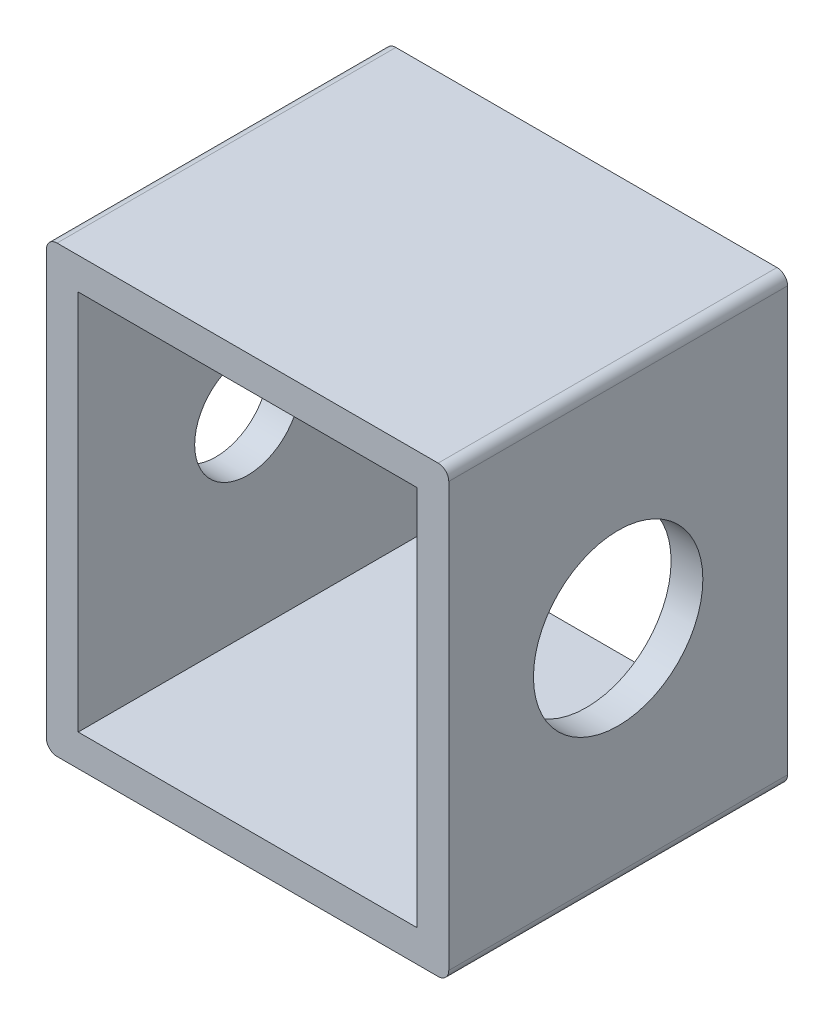
ISO-10303-21;
HEADER;
FILE_DESCRIPTION(('STEP AP214'),'2;1');
FILE_NAME('part.step','',(''),(''),'','','');
FILE_SCHEMA(('AUTOMOTIVE_DESIGN { 1 0 10303 214 1 1 1 1 }'));
ENDSEC;
DATA;
#1=APPLICATION_CONTEXT('core data for automotive mechanical design processes');
#2=APPLICATION_PROTOCOL_DEFINITION('international standard','automotive_design',2000,#1);
#3=PRODUCT_CONTEXT('',#1,'mechanical');
#4=PRODUCT('Part','Part','',(#3));
#5=PRODUCT_RELATED_PRODUCT_CATEGORY('part','',(#4));
#6=PRODUCT_DEFINITION_FORMATION('','',#4);
#7=PRODUCT_DEFINITION_CONTEXT('part definition',#1,'design');
#8=PRODUCT_DEFINITION('design','',#6,#7);
#9=PRODUCT_DEFINITION_SHAPE('','',#8);
#10=(LENGTH_UNIT() NAMED_UNIT(*) SI_UNIT(.MILLI.,.METRE.));
#11=(NAMED_UNIT(*) PLANE_ANGLE_UNIT() SI_UNIT($,.RADIAN.));
#12=(NAMED_UNIT(*) SI_UNIT($,.STERADIAN.) SOLID_ANGLE_UNIT());
#13=UNCERTAINTY_MEASURE_WITH_UNIT(LENGTH_MEASURE(1.E-05),#10,'distance_accuracy_value','');
#14=(GEOMETRIC_REPRESENTATION_CONTEXT(3) GLOBAL_UNCERTAINTY_ASSIGNED_CONTEXT((#13)) GLOBAL_UNIT_ASSIGNED_CONTEXT((#10,
#11,#12)) REPRESENTATION_CONTEXT('',''));
#15=CARTESIAN_POINT('',(0.,0.,0.));
#16=DIRECTION('',(0.,0.,1.));
#17=DIRECTION('',(1.,0.,0.));
#18=AXIS2_PLACEMENT_3D('',#15,#16,#17);
#19=CARTESIAN_POINT('',(18.5,0.5,16.));
#20=DIRECTION('',(0.,0.,-1.));
#21=DIRECTION('',(-1.,0.,0.));
#22=AXIS2_PLACEMENT_3D('',#19,#20,#21);
#23=CYLINDRICAL_SURFACE('',#22,0.499999999999999);
#24=CARTESIAN_POINT('',(18.5,0.5,0.));
#25=DIRECTION('',(0.,0.,1.));
#26=DIRECTION('',(1.,0.,0.));
#27=AXIS2_PLACEMENT_3D('',#24,#25,#26);
#28=CIRCLE('',#27,0.499999999999999);
#29=CARTESIAN_POINT('',(18.5,0.,0.));
#30=VERTEX_POINT('',#29);
#31=CARTESIAN_POINT('',(19.,0.5,0.));
#32=VERTEX_POINT('',#31);
#33=EDGE_CURVE('E129',#30,#32,#28,.T.);
#34=ORIENTED_EDGE('',*,*,#33,.T.);
#35=DIRECTION('',(0.,0.,-1.));
#36=VECTOR('',#35,1.);
#37=CARTESIAN_POINT('',(19.,0.5,16.));
#38=LINE('',#37,#36);
#39=CARTESIAN_POINT('',(19.,0.5,16.));
#40=VERTEX_POINT('',#39);
#41=EDGE_CURVE('E11',#40,#32,#38,.T.);
#42=ORIENTED_EDGE('',*,*,#41,.F.);
#43=CARTESIAN_POINT('',(18.5,0.5,16.));
#44=DIRECTION('',(0.,0.,1.));
#45=DIRECTION('',(1.,0.,0.));
#46=AXIS2_PLACEMENT_3D('',#43,#44,#45);
#47=CIRCLE('',#46,0.499999999999999);
#48=CARTESIAN_POINT('',(18.5,0.,16.));
#49=VERTEX_POINT('',#48);
#50=EDGE_CURVE('E159',#49,#40,#47,.T.);
#51=ORIENTED_EDGE('',*,*,#50,.F.);
#52=DIRECTION('',(0.,0.,-1.));
#53=VECTOR('',#52,1.);
#54=CARTESIAN_POINT('',(18.5,0.,16.));
#55=LINE('',#54,#53);
#56=EDGE_CURVE('E177',#49,#30,#55,.T.);
#57=ORIENTED_EDGE('',*,*,#56,.T.);
#58=EDGE_LOOP('',(#34,#42,#51,#57));
#59=FACE_BOUND('',#58,.T.);
#60=ADVANCED_FACE('F34',(#59),#23,.T.);
#61=CARTESIAN_POINT('',(19.,0.5,16.));
#62=DIRECTION('',(-1.,0.,0.));
#63=DIRECTION('',(0.,-1.,0.));
#64=AXIS2_PLACEMENT_3D('',#61,#62,#63);
#65=PLANE('',#64);
#66=CARTESIAN_POINT('',(19.,10.5,8.));
#67=DIRECTION('',(1.,0.,0.));
#68=DIRECTION('',(0.,1.,0.));
#69=AXIS2_PLACEMENT_3D('',#66,#67,#68);
#70=CIRCLE('',#69,4.);
#71=CARTESIAN_POINT('',(19.,14.5,8.));
#72=VERTEX_POINT('',#71);
#73=EDGE_CURVE('E385',#72,#72,#70,.T.);
#74=ORIENTED_EDGE('',*,*,#73,.F.);
#75=EDGE_LOOP('',(#74));
#76=FACE_BOUND('',#75,.T.);
#77=DIRECTION('',(0.,1.,0.));
#78=VECTOR('',#77,1.);
#79=CARTESIAN_POINT('',(19.,0.5,0.));
#80=LINE('',#79,#78);
#81=CARTESIAN_POINT('',(19.,20.5,0.));
#82=VERTEX_POINT('',#81);
#83=EDGE_CURVE('E180',#32,#82,#80,.T.);
#84=ORIENTED_EDGE('',*,*,#83,.T.);
#85=DIRECTION('',(0.,0.,-1.));
#86=VECTOR('',#85,1.);
#87=CARTESIAN_POINT('',(19.,20.5,16.));
#88=LINE('',#87,#86);
#89=CARTESIAN_POINT('',(19.,20.5,16.));
#90=VERTEX_POINT('',#89);
#91=EDGE_CURVE('E41',#90,#82,#88,.T.);
#92=ORIENTED_EDGE('',*,*,#91,.F.);
#93=DIRECTION('',(0.,1.,0.));
#94=VECTOR('',#93,1.);
#95=CARTESIAN_POINT('',(19.,0.5,16.));
#96=LINE('',#95,#94);
#97=EDGE_CURVE('E162',#40,#90,#96,.T.);
#98=ORIENTED_EDGE('',*,*,#97,.F.);
#99=ORIENTED_EDGE('',*,*,#41,.T.);
#100=EDGE_LOOP('',(#84,#92,#98,#99));
#101=FACE_BOUND('',#100,.T.);
#102=ADVANCED_FACE('F235',(#76,#101),#65,.F.);
#103=CARTESIAN_POINT('',(18.5,20.5,16.));
#104=DIRECTION('',(0.,0.,-1.));
#105=DIRECTION('',(-1.,0.,0.));
#106=AXIS2_PLACEMENT_3D('',#103,#104,#105);
#107=CYLINDRICAL_SURFACE('',#106,0.5);
#108=CARTESIAN_POINT('',(18.5,20.5,0.));
#109=DIRECTION('',(0.,0.,1.));
#110=DIRECTION('',(1.,0.,0.));
#111=AXIS2_PLACEMENT_3D('',#108,#109,#110);
#112=CIRCLE('',#111,0.5);
#113=CARTESIAN_POINT('',(18.5,21.,0.));
#114=VERTEX_POINT('',#113);
#115=EDGE_CURVE('E182',#82,#114,#112,.T.);
#116=ORIENTED_EDGE('',*,*,#115,.T.);
#117=DIRECTION('',(0.,0.,-1.));
#118=VECTOR('',#117,1.);
#119=CARTESIAN_POINT('',(18.5,21.,16.));
#120=LINE('',#119,#118);
#121=CARTESIAN_POINT('',(18.5,21.,16.));
#122=VERTEX_POINT('',#121);
#123=EDGE_CURVE('E207',#122,#114,#120,.T.);
#124=ORIENTED_EDGE('',*,*,#123,.F.);
#125=CARTESIAN_POINT('',(18.5,20.5,16.));
#126=DIRECTION('',(0.,0.,1.));
#127=DIRECTION('',(1.,0.,0.));
#128=AXIS2_PLACEMENT_3D('',#125,#126,#127);
#129=CIRCLE('',#128,0.5);
#130=EDGE_CURVE('E165',#90,#122,#129,.T.);
#131=ORIENTED_EDGE('',*,*,#130,.F.);
#132=ORIENTED_EDGE('',*,*,#91,.T.);
#133=EDGE_LOOP('',(#116,#124,#131,#132));
#134=FACE_BOUND('',#133,.T.);
#135=ADVANCED_FACE('F214',(#134),#107,.T.);
#136=CARTESIAN_POINT('',(18.5,21.,16.));
#137=DIRECTION('',(0.,-1.,0.));
#138=DIRECTION('',(0.,0.,-1.));
#139=AXIS2_PLACEMENT_3D('',#136,#137,#138);
#140=PLANE('',#139);
#141=DIRECTION('',(-1.,0.,0.));
#142=VECTOR('',#141,1.);
#143=CARTESIAN_POINT('',(18.5,21.,0.));
#144=LINE('',#143,#142);
#145=CARTESIAN_POINT('',(0.5,21.,0.));
#146=VERTEX_POINT('',#145);
#147=EDGE_CURVE('E184',#114,#146,#144,.T.);
#148=ORIENTED_EDGE('',*,*,#147,.T.);
#149=DIRECTION('',(0.,0.,-1.));
#150=VECTOR('',#149,1.);
#151=CARTESIAN_POINT('',(0.5,21.,16.));
#152=LINE('',#151,#150);
#153=CARTESIAN_POINT('',(0.5,21.,16.));
#154=VERTEX_POINT('',#153);
#155=EDGE_CURVE('E204',#154,#146,#152,.T.);
#156=ORIENTED_EDGE('',*,*,#155,.F.);
#157=DIRECTION('',(-1.,0.,0.));
#158=VECTOR('',#157,1.);
#159=CARTESIAN_POINT('',(18.5,21.,16.));
#160=LINE('',#159,#158);
#161=EDGE_CURVE('E167',#122,#154,#160,.T.);
#162=ORIENTED_EDGE('',*,*,#161,.F.);
#163=ORIENTED_EDGE('',*,*,#123,.T.);
#164=EDGE_LOOP('',(#148,#156,#162,#163));
#165=FACE_BOUND('',#164,.T.);
#166=ADVANCED_FACE('F223',(#165),#140,.F.);
#167=CARTESIAN_POINT('',(0.5,20.5,16.));
#168=DIRECTION('',(0.,0.,-1.));
#169=DIRECTION('',(-1.,0.,0.));
#170=AXIS2_PLACEMENT_3D('',#167,#168,#169);
#171=CYLINDRICAL_SURFACE('',#170,0.500000000000002);
#172=CARTESIAN_POINT('',(0.5,20.5,0.));
#173=DIRECTION('',(0.,0.,1.));
#174=DIRECTION('',(1.,0.,0.));
#175=AXIS2_PLACEMENT_3D('',#172,#173,#174);
#176=CIRCLE('',#175,0.500000000000002);
#177=CARTESIAN_POINT('',(0.,20.5,0.));
#178=VERTEX_POINT('',#177);
#179=EDGE_CURVE('E186',#146,#178,#176,.T.);
#180=ORIENTED_EDGE('',*,*,#179,.T.);
#181=DIRECTION('',(0.,0.,-1.));
#182=VECTOR('',#181,1.);
#183=CARTESIAN_POINT('',(0.,20.5,16.));
#184=LINE('',#183,#182);
#185=CARTESIAN_POINT('',(0.,20.5,16.));
#186=VERTEX_POINT('',#185);
#187=EDGE_CURVE('E201',#186,#178,#184,.T.);
#188=ORIENTED_EDGE('',*,*,#187,.F.);
#189=CARTESIAN_POINT('',(0.5,20.5,16.));
#190=DIRECTION('',(0.,0.,1.));
#191=DIRECTION('',(1.,0.,0.));
#192=AXIS2_PLACEMENT_3D('',#189,#190,#191);
#193=CIRCLE('',#192,0.500000000000002);
#194=EDGE_CURVE('E169',#154,#186,#193,.T.);
#195=ORIENTED_EDGE('',*,*,#194,.F.);
#196=ORIENTED_EDGE('',*,*,#155,.T.);
#197=EDGE_LOOP('',(#180,#188,#195,#196));
#198=FACE_BOUND('',#197,.T.);
#199=ADVANCED_FACE('F227',(#198),#171,.T.);
#200=CARTESIAN_POINT('',(0.,20.5,16.));
#201=DIRECTION('',(1.,0.,0.));
#202=DIRECTION('',(0.,1.,0.));
#203=AXIS2_PLACEMENT_3D('',#200,#201,#202);
#204=PLANE('',#203);
#205=CARTESIAN_POINT('',(0.,10.5,8.));
#206=DIRECTION('',(-1.,0.,0.));
#207=DIRECTION('',(0.,-1.,0.));
#208=AXIS2_PLACEMENT_3D('',#205,#206,#207);
#209=CIRCLE('',#208,2.5);
#210=CARTESIAN_POINT('',(0.,8.,8.));
#211=VERTEX_POINT('',#210);
#212=EDGE_CURVE('E140',#211,#211,#209,.T.);
#213=ORIENTED_EDGE('',*,*,#212,.F.);
#214=EDGE_LOOP('',(#213));
#215=FACE_BOUND('',#214,.T.);
#216=DIRECTION('',(0.,-1.,0.));
#217=VECTOR('',#216,1.);
#218=CARTESIAN_POINT('',(0.,20.5,0.));
#219=LINE('',#218,#217);
#220=CARTESIAN_POINT('',(0.,0.5,0.));
#221=VERTEX_POINT('',#220);
#222=EDGE_CURVE('E188',#178,#221,#219,.T.);
#223=ORIENTED_EDGE('',*,*,#222,.T.);
#224=DIRECTION('',(0.,0.,-1.));
#225=VECTOR('',#224,1.);
#226=CARTESIAN_POINT('',(0.,0.5,16.));
#227=LINE('',#226,#225);
#228=CARTESIAN_POINT('',(0.,0.5,16.));
#229=VERTEX_POINT('',#228);
#230=EDGE_CURVE('E198',#229,#221,#227,.T.);
#231=ORIENTED_EDGE('',*,*,#230,.F.);
#232=DIRECTION('',(0.,-1.,0.));
#233=VECTOR('',#232,1.);
#234=CARTESIAN_POINT('',(0.,20.5,16.));
#235=LINE('',#234,#233);
#236=EDGE_CURVE('E171',#186,#229,#235,.T.);
#237=ORIENTED_EDGE('',*,*,#236,.F.);
#238=ORIENTED_EDGE('',*,*,#187,.T.);
#239=EDGE_LOOP('',(#223,#231,#237,#238));
#240=FACE_BOUND('',#239,.T.);
#241=ADVANCED_FACE('F248',(#215,#240),#204,.F.);
#242=CARTESIAN_POINT('',(0.500000000000002,0.5,16.));
#243=DIRECTION('',(0.,0.,-1.));
#244=DIRECTION('',(-1.,0.,0.));
#245=AXIS2_PLACEMENT_3D('',#242,#243,#244);
#246=CYLINDRICAL_SURFACE('',#245,0.5);
#247=CARTESIAN_POINT('',(0.500000000000002,0.5,0.));
#248=DIRECTION('',(0.,0.,1.));
#249=DIRECTION('',(-1.,0.,0.));
#250=AXIS2_PLACEMENT_3D('',#247,#248,#249);
#251=CIRCLE('',#250,0.5);
#252=CARTESIAN_POINT('',(0.500000000000002,0.,0.));
#253=VERTEX_POINT('',#252);
#254=EDGE_CURVE('E190',#221,#253,#251,.T.);
#255=ORIENTED_EDGE('',*,*,#254,.T.);
#256=DIRECTION('',(0.,0.,-1.));
#257=VECTOR('',#256,1.);
#258=CARTESIAN_POINT('',(0.500000000000002,0.,16.));
#259=LINE('',#258,#257);
#260=CARTESIAN_POINT('',(0.500000000000002,0.,16.));
#261=VERTEX_POINT('',#260);
#262=EDGE_CURVE('E195',#261,#253,#259,.T.);
#263=ORIENTED_EDGE('',*,*,#262,.F.);
#264=CARTESIAN_POINT('',(0.500000000000002,0.5,16.));
#265=DIRECTION('',(0.,0.,1.));
#266=DIRECTION('',(-1.,0.,0.));
#267=AXIS2_PLACEMENT_3D('',#264,#265,#266);
#268=CIRCLE('',#267,0.5);
#269=EDGE_CURVE('E173',#229,#261,#268,.T.);
#270=ORIENTED_EDGE('',*,*,#269,.F.);
#271=ORIENTED_EDGE('',*,*,#230,.T.);
#272=EDGE_LOOP('',(#255,#263,#270,#271));
#273=FACE_BOUND('',#272,.T.);
#274=ADVANCED_FACE('F246',(#273),#246,.T.);
#275=CARTESIAN_POINT('',(0.500000000000002,0.,16.));
#276=DIRECTION('',(0.,1.,0.));
#277=DIRECTION('',(0.,0.,1.));
#278=AXIS2_PLACEMENT_3D('',#275,#276,#277);
#279=PLANE('',#278);
#280=DIRECTION('',(1.,0.,0.));
#281=VECTOR('',#280,1.);
#282=CARTESIAN_POINT('',(0.500000000000002,0.,0.));
#283=LINE('',#282,#281);
#284=EDGE_CURVE('E163',#253,#30,#283,.T.);
#285=ORIENTED_EDGE('',*,*,#284,.T.);
#286=ORIENTED_EDGE('',*,*,#56,.F.);
#287=DIRECTION('',(1.,0.,0.));
#288=VECTOR('',#287,1.);
#289=CARTESIAN_POINT('',(0.500000000000002,0.,16.));
#290=LINE('',#289,#288);
#291=EDGE_CURVE('E175',#261,#49,#290,.T.);
#292=ORIENTED_EDGE('',*,*,#291,.F.);
#293=ORIENTED_EDGE('',*,*,#262,.T.);
#294=EDGE_LOOP('',(#285,#286,#292,#293));
#295=FACE_BOUND('',#294,.T.);
#296=ADVANCED_FACE('F241',(#295),#279,.F.);
#297=CARTESIAN_POINT('',(18.5,0.5,16.));
#298=DIRECTION('',(0.,0.,1.));
#299=DIRECTION('',(1.,0.,0.));
#300=AXIS2_PLACEMENT_3D('',#297,#298,#299);
#301=PLANE('',#300);
#302=DIRECTION('',(1.,0.,0.));
#303=VECTOR('',#302,1.);
#304=CARTESIAN_POINT('',(0.500000000000002,1.5,16.));
#305=LINE('',#304,#303);
#306=CARTESIAN_POINT('',(1.5,1.5,16.));
#307=VERTEX_POINT('',#306);
#308=CARTESIAN_POINT('',(17.5,1.5,16.));
#309=VERTEX_POINT('',#308);
#310=EDGE_CURVE('E126',#307,#309,#305,.T.);
#311=ORIENTED_EDGE('',*,*,#310,.F.);
#312=DIRECTION('',(0.,-1.,0.));
#313=VECTOR('',#312,1.);
#314=CARTESIAN_POINT('',(1.5,20.5,16.));
#315=LINE('',#314,#313);
#316=CARTESIAN_POINT('',(1.5,19.5,16.));
#317=VERTEX_POINT('',#316);
#318=EDGE_CURVE('E155',#317,#307,#315,.T.);
#319=ORIENTED_EDGE('',*,*,#318,.F.);
#320=DIRECTION('',(-1.,0.,0.));
#321=VECTOR('',#320,1.);
#322=CARTESIAN_POINT('',(18.5,19.5,16.));
#323=LINE('',#322,#321);
#324=CARTESIAN_POINT('',(17.5,19.5,16.));
#325=VERTEX_POINT('',#324);
#326=EDGE_CURVE('E148',#325,#317,#323,.T.);
#327=ORIENTED_EDGE('',*,*,#326,.F.);
#328=DIRECTION('',(0.,1.,0.));
#329=VECTOR('',#328,1.);
#330=CARTESIAN_POINT('',(17.5,0.5,16.));
#331=LINE('',#330,#329);
#332=EDGE_CURVE('E146',#309,#325,#331,.T.);
#333=ORIENTED_EDGE('',*,*,#332,.F.);
#334=EDGE_LOOP('',(#311,#319,#327,#333));
#335=FACE_BOUND('',#334,.T.);
#336=ORIENTED_EDGE('',*,*,#50,.T.);
#337=ORIENTED_EDGE('',*,*,#97,.T.);
#338=ORIENTED_EDGE('',*,*,#130,.T.);
#339=ORIENTED_EDGE('',*,*,#161,.T.);
#340=ORIENTED_EDGE('',*,*,#194,.T.);
#341=ORIENTED_EDGE('',*,*,#236,.T.);
#342=ORIENTED_EDGE('',*,*,#269,.T.);
#343=ORIENTED_EDGE('',*,*,#291,.T.);
#344=EDGE_LOOP('',(#336,#337,#338,#339,#340,#341,#342,#343));
#345=FACE_BOUND('',#344,.T.);
#346=ADVANCED_FACE('F231',(#335,#345),#301,.T.);
#347=CARTESIAN_POINT('',(18.5,0.5,0.));
#348=DIRECTION('',(0.,0.,1.));
#349=DIRECTION('',(1.,0.,0.));
#350=AXIS2_PLACEMENT_3D('',#347,#348,#349);
#351=PLANE('',#350);
#352=DIRECTION('',(1.,0.,0.));
#353=VECTOR('',#352,1.);
#354=CARTESIAN_POINT('',(0.500000000000002,1.5,0.));
#355=LINE('',#354,#353);
#356=CARTESIAN_POINT('',(1.5,1.5,0.));
#357=VERTEX_POINT('',#356);
#358=CARTESIAN_POINT('',(17.5,1.5,0.));
#359=VERTEX_POINT('',#358);
#360=EDGE_CURVE('E123',#357,#359,#355,.T.);
#361=ORIENTED_EDGE('',*,*,#360,.T.);
#362=DIRECTION('',(0.,1.,0.));
#363=VECTOR('',#362,1.);
#364=CARTESIAN_POINT('',(17.5,0.5,0.));
#365=LINE('',#364,#363);
#366=CARTESIAN_POINT('',(17.5,19.5,0.));
#367=VERTEX_POINT('',#366);
#368=EDGE_CURVE('E134',#359,#367,#365,.T.);
#369=ORIENTED_EDGE('',*,*,#368,.T.);
#370=DIRECTION('',(-1.,0.,0.));
#371=VECTOR('',#370,1.);
#372=CARTESIAN_POINT('',(18.5,19.5,0.));
#373=LINE('',#372,#371);
#374=CARTESIAN_POINT('',(1.5,19.5,0.));
#375=VERTEX_POINT('',#374);
#376=EDGE_CURVE('E139',#367,#375,#373,.T.);
#377=ORIENTED_EDGE('',*,*,#376,.T.);
#378=DIRECTION('',(0.,-1.,0.));
#379=VECTOR('',#378,1.);
#380=CARTESIAN_POINT('',(1.5,20.5,0.));
#381=LINE('',#380,#379);
#382=EDGE_CURVE('E145',#375,#357,#381,.T.);
#383=ORIENTED_EDGE('',*,*,#382,.T.);
#384=EDGE_LOOP('',(#361,#369,#377,#383));
#385=FACE_BOUND('',#384,.T.);
#386=ORIENTED_EDGE('',*,*,#33,.F.);
#387=ORIENTED_EDGE('',*,*,#284,.F.);
#388=ORIENTED_EDGE('',*,*,#254,.F.);
#389=ORIENTED_EDGE('',*,*,#222,.F.);
#390=ORIENTED_EDGE('',*,*,#179,.F.);
#391=ORIENTED_EDGE('',*,*,#147,.F.);
#392=ORIENTED_EDGE('',*,*,#115,.F.);
#393=ORIENTED_EDGE('',*,*,#83,.F.);
#394=EDGE_LOOP('',(#386,#387,#388,#389,#390,#391,#392,#393));
#395=FACE_BOUND('',#394,.T.);
#396=ADVANCED_FACE('F143',(#385,#395),#351,.F.);
#397=CARTESIAN_POINT('',(17.5,0.5,16.));
#398=DIRECTION('',(-1.,0.,0.));
#399=DIRECTION('',(0.,-1.,0.));
#400=AXIS2_PLACEMENT_3D('',#397,#398,#399);
#401=PLANE('',#400);
#402=CARTESIAN_POINT('',(17.5,10.5,8.));
#403=DIRECTION('',(-1.,0.,0.));
#404=DIRECTION('',(0.,-1.,0.));
#405=AXIS2_PLACEMENT_3D('',#402,#403,#404);
#406=CIRCLE('',#405,4.);
#407=CARTESIAN_POINT('',(17.5,6.5,8.));
#408=VERTEX_POINT('',#407);
#409=EDGE_CURVE('E383',#408,#408,#406,.F.);
#410=ORIENTED_EDGE('',*,*,#409,.T.);
#411=EDGE_LOOP('',(#410));
#412=FACE_BOUND('',#411,.T.);
#413=ORIENTED_EDGE('',*,*,#368,.F.);
#414=DIRECTION('',(0.,0.,-1.));
#415=VECTOR('',#414,1.);
#416=CARTESIAN_POINT('',(17.5,1.5,16.));
#417=LINE('',#416,#415);
#418=EDGE_CURVE('E118',#309,#359,#417,.T.);
#419=ORIENTED_EDGE('',*,*,#418,.F.);
#420=ORIENTED_EDGE('',*,*,#332,.T.);
#421=DIRECTION('',(0.,0.,-1.));
#422=VECTOR('',#421,1.);
#423=CARTESIAN_POINT('',(17.5,19.5,16.));
#424=LINE('',#423,#422);
#425=EDGE_CURVE('E130',#325,#367,#424,.T.);
#426=ORIENTED_EDGE('',*,*,#425,.T.);
#427=EDGE_LOOP('',(#413,#419,#420,#426));
#428=FACE_BOUND('',#427,.T.);
#429=ADVANCED_FACE('F135',(#412,#428),#401,.T.);
#430=CARTESIAN_POINT('',(18.5,19.5,16.));
#431=DIRECTION('',(0.,-1.,0.));
#432=DIRECTION('',(0.,0.,-1.));
#433=AXIS2_PLACEMENT_3D('',#430,#431,#432);
#434=PLANE('',#433);
#435=ORIENTED_EDGE('',*,*,#376,.F.);
#436=ORIENTED_EDGE('',*,*,#425,.F.);
#437=ORIENTED_EDGE('',*,*,#326,.T.);
#438=DIRECTION('',(0.,0.,-1.));
#439=VECTOR('',#438,1.);
#440=CARTESIAN_POINT('',(1.5,19.5,16.));
#441=LINE('',#440,#439);
#442=EDGE_CURVE('E48',#317,#375,#441,.T.);
#443=ORIENTED_EDGE('',*,*,#442,.T.);
#444=EDGE_LOOP('',(#435,#436,#437,#443));
#445=FACE_BOUND('',#444,.T.);
#446=ADVANCED_FACE('F318',(#445),#434,.T.);
#447=CARTESIAN_POINT('',(1.5,20.5,16.));
#448=DIRECTION('',(1.,0.,0.));
#449=DIRECTION('',(0.,1.,0.));
#450=AXIS2_PLACEMENT_3D('',#447,#448,#449);
#451=PLANE('',#450);
#452=CARTESIAN_POINT('',(1.5,10.5,8.));
#453=DIRECTION('',(1.,0.,0.));
#454=DIRECTION('',(0.,1.,0.));
#455=AXIS2_PLACEMENT_3D('',#452,#453,#454);
#456=CIRCLE('',#455,2.5);
#457=CARTESIAN_POINT('',(1.5,13.,8.));
#458=VERTEX_POINT('',#457);
#459=EDGE_CURVE('E386',#458,#458,#456,.F.);
#460=ORIENTED_EDGE('',*,*,#459,.T.);
#461=EDGE_LOOP('',(#460));
#462=FACE_BOUND('',#461,.T.);
#463=ORIENTED_EDGE('',*,*,#382,.F.);
#464=ORIENTED_EDGE('',*,*,#442,.F.);
#465=ORIENTED_EDGE('',*,*,#318,.T.);
#466=DIRECTION('',(0.,0.,-1.));
#467=VECTOR('',#466,1.);
#468=CARTESIAN_POINT('',(1.5,1.5,16.));
#469=LINE('',#468,#467);
#470=EDGE_CURVE('E158',#307,#357,#469,.T.);
#471=ORIENTED_EDGE('',*,*,#470,.T.);
#472=EDGE_LOOP('',(#463,#464,#465,#471));
#473=FACE_BOUND('',#472,.T.);
#474=ADVANCED_FACE('F323',(#462,#473),#451,.T.);
#475=CARTESIAN_POINT('',(0.500000000000002,1.5,16.));
#476=DIRECTION('',(0.,1.,0.));
#477=DIRECTION('',(0.,0.,1.));
#478=AXIS2_PLACEMENT_3D('',#475,#476,#477);
#479=PLANE('',#478);
#480=ORIENTED_EDGE('',*,*,#360,.F.);
#481=ORIENTED_EDGE('',*,*,#470,.F.);
#482=ORIENTED_EDGE('',*,*,#310,.T.);
#483=ORIENTED_EDGE('',*,*,#418,.T.);
#484=EDGE_LOOP('',(#480,#481,#482,#483));
#485=FACE_BOUND('',#484,.T.);
#486=ADVANCED_FACE('F120',(#485),#479,.T.);
#487=CARTESIAN_POINT('',(19.001,10.5,8.));
#488=DIRECTION('',(-1.,0.,0.));
#489=DIRECTION('',(0.,-1.,0.));
#490=AXIS2_PLACEMENT_3D('',#487,#488,#489);
#491=CYLINDRICAL_SURFACE('',#490,2.5);
#492=ORIENTED_EDGE('',*,*,#459,.F.);
#493=EDGE_LOOP('',(#492));
#494=FACE_BOUND('',#493,.T.);
#495=ORIENTED_EDGE('',*,*,#212,.T.);
#496=EDGE_LOOP('',(#495));
#497=FACE_BOUND('',#496,.T.);
#498=ADVANCED_FACE('F333',(#494,#497),#491,.F.);
#499=CARTESIAN_POINT('',(-0.001000000000001,10.5,8.));
#500=DIRECTION('',(1.,0.,0.));
#501=DIRECTION('',(0.,1.,0.));
#502=AXIS2_PLACEMENT_3D('',#499,#500,#501);
#503=CYLINDRICAL_SURFACE('',#502,4.);
#504=ORIENTED_EDGE('',*,*,#409,.F.);
#505=EDGE_LOOP('',(#504));
#506=FACE_BOUND('',#505,.T.);
#507=ORIENTED_EDGE('',*,*,#73,.T.);
#508=EDGE_LOOP('',(#507));
#509=FACE_BOUND('',#508,.T.);
#510=ADVANCED_FACE('F352',(#506,#509),#503,.F.);
#511=CLOSED_SHELL('',(#60,#102,#135,#166,#199,#241,#274,#296,#346,#396,#429,#446,#474,#486,#498,#510));
#512=MANIFOLD_SOLID_BREP('B2',#511);
#513=ADVANCED_BREP_SHAPE_REPRESENTATION('',(#18,#512),#14);
#514=SHAPE_DEFINITION_REPRESENTATION(#9,#513);
ENDSEC;
END-ISO-10303-21;
